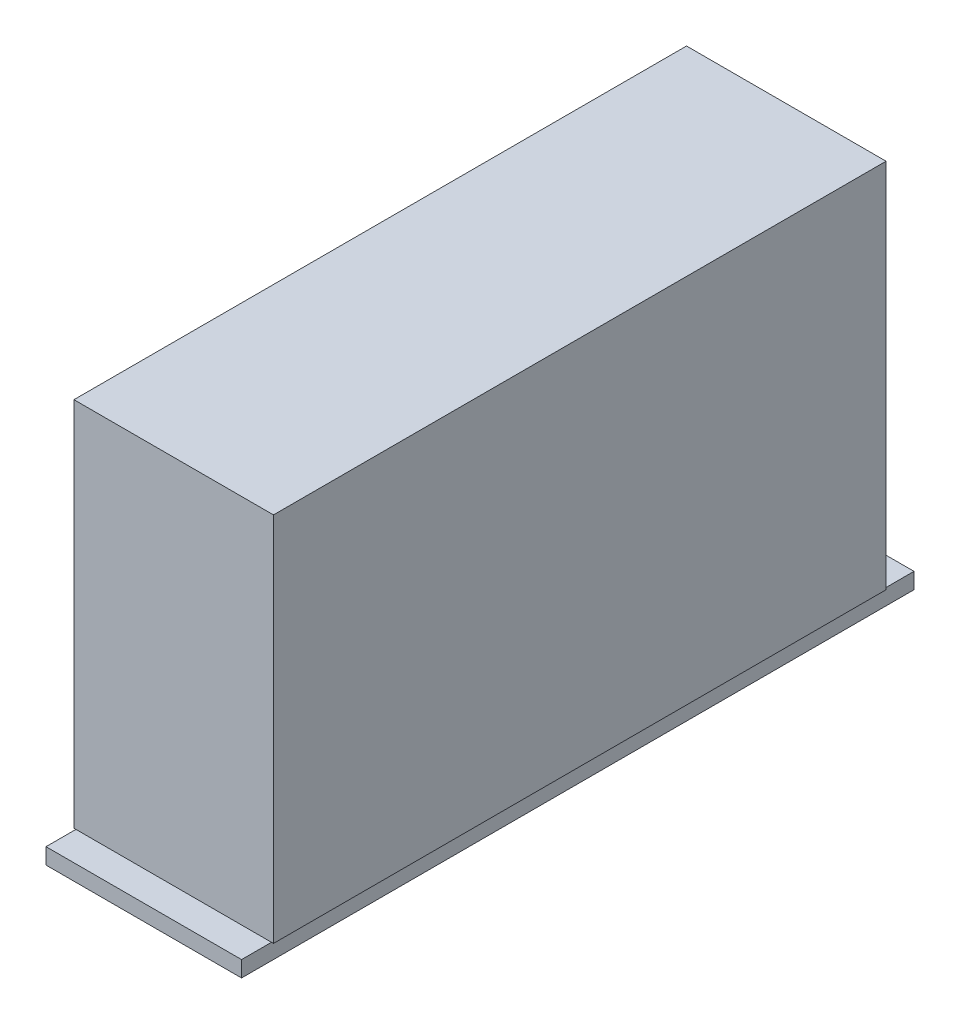
ISO-10303-21;
HEADER;
FILE_DESCRIPTION(('STEP AP214'),'2;1');
FILE_NAME('part.step','',(''),(''),'','','');
FILE_SCHEMA(('AUTOMOTIVE_DESIGN { 1 0 10303 214 1 1 1 1 }'));
ENDSEC;
DATA;
#1=APPLICATION_CONTEXT('core data for automotive mechanical design processes');
#2=APPLICATION_PROTOCOL_DEFINITION('international standard','automotive_design',2000,#1);
#3=PRODUCT_CONTEXT('',#1,'mechanical');
#4=PRODUCT('Part','Part','',(#3));
#5=PRODUCT_RELATED_PRODUCT_CATEGORY('part','',(#4));
#6=PRODUCT_DEFINITION_FORMATION('','',#4);
#7=PRODUCT_DEFINITION_CONTEXT('part definition',#1,'design');
#8=PRODUCT_DEFINITION('design','',#6,#7);
#9=PRODUCT_DEFINITION_SHAPE('','',#8);
#10=(LENGTH_UNIT() NAMED_UNIT(*) SI_UNIT(.MILLI.,.METRE.));
#11=(NAMED_UNIT(*) PLANE_ANGLE_UNIT() SI_UNIT($,.RADIAN.));
#12=(NAMED_UNIT(*) SI_UNIT($,.STERADIAN.) SOLID_ANGLE_UNIT());
#13=UNCERTAINTY_MEASURE_WITH_UNIT(LENGTH_MEASURE(1.E-05),#10,'distance_accuracy_value','');
#14=(GEOMETRIC_REPRESENTATION_CONTEXT(3) GLOBAL_UNCERTAINTY_ASSIGNED_CONTEXT((#13)) GLOBAL_UNIT_ASSIGNED_CONTEXT((#10,
#11,#12)) REPRESENTATION_CONTEXT('',''));
#15=CARTESIAN_POINT('',(0.,0.,0.));
#16=DIRECTION('',(0.,0.,1.));
#17=DIRECTION('',(1.,0.,0.));
#18=AXIS2_PLACEMENT_3D('',#15,#16,#17);
#19=CARTESIAN_POINT('',(-4.9,0.8,16.85));
#20=DIRECTION('',(0.,1.,0.));
#21=DIRECTION('',(0.,0.,1.));
#22=AXIS2_PLACEMENT_3D('',#19,#20,#21);
#23=PLANE('',#22);
#24=DIRECTION('',(1.,0.,0.));
#25=VECTOR('',#24,1.);
#26=CARTESIAN_POINT('',(5.,0.8,15.35));
#27=LINE('',#26,#25);
#28=CARTESIAN_POINT('',(-4.9,0.8,15.35));
#29=VERTEX_POINT('',#28);
#30=CARTESIAN_POINT('',(4.9,0.8,15.35));
#31=VERTEX_POINT('',#30);
#32=EDGE_CURVE('E11',#29,#31,#27,.T.);
#33=ORIENTED_EDGE('',*,*,#32,.F.);
#34=DIRECTION('',(0.,0.,1.));
#35=VECTOR('',#34,1.);
#36=CARTESIAN_POINT('',(-4.9,0.8,-16.85));
#37=LINE('',#36,#35);
#38=CARTESIAN_POINT('',(-4.9,0.8,16.85));
#39=VERTEX_POINT('',#38);
#40=EDGE_CURVE('E148',#29,#39,#37,.T.);
#41=ORIENTED_EDGE('',*,*,#40,.T.);
#42=DIRECTION('',(1.,0.,0.));
#43=VECTOR('',#42,1.);
#44=CARTESIAN_POINT('',(-4.9,0.8,16.85));
#45=LINE('',#44,#43);
#46=CARTESIAN_POINT('',(4.9,0.8,16.85));
#47=VERTEX_POINT('',#46);
#48=EDGE_CURVE('E151',#39,#47,#45,.T.);
#49=ORIENTED_EDGE('',*,*,#48,.T.);
#50=DIRECTION('',(0.,0.,-1.));
#51=VECTOR('',#50,1.);
#52=CARTESIAN_POINT('',(4.9,0.8,-16.85));
#53=LINE('',#52,#51);
#54=EDGE_CURVE('E155',#47,#31,#53,.T.);
#55=ORIENTED_EDGE('',*,*,#54,.T.);
#56=EDGE_LOOP('',(#33,#41,#49,#55));
#57=FACE_BOUND('',#56,.T.);
#58=ADVANCED_FACE('F17',(#57),#23,.T.);
#59=CARTESIAN_POINT('',(-4.9,0.8,-16.85));
#60=DIRECTION('',(1.,0.,0.));
#61=DIRECTION('',(0.,0.,-1.));
#62=AXIS2_PLACEMENT_3D('',#59,#60,#61);
#63=PLANE('',#62);
#64=DIRECTION('',(0.,0.,1.));
#65=VECTOR('',#64,1.);
#66=CARTESIAN_POINT('',(-4.9,0.,-16.85));
#67=LINE('',#66,#65);
#68=CARTESIAN_POINT('',(-4.9,0.,-16.85));
#69=VERTEX_POINT('',#68);
#70=CARTESIAN_POINT('',(-4.9,0.,16.85));
#71=VERTEX_POINT('',#70);
#72=EDGE_CURVE('E116',#69,#71,#67,.T.);
#73=ORIENTED_EDGE('',*,*,#72,.T.);
#74=DIRECTION('',(0.,-1.,0.));
#75=VECTOR('',#74,1.);
#76=CARTESIAN_POINT('',(-4.9,0.8,16.85));
#77=LINE('',#76,#75);
#78=EDGE_CURVE('E21',#39,#71,#77,.T.);
#79=ORIENTED_EDGE('',*,*,#78,.F.);
#80=ORIENTED_EDGE('',*,*,#40,.F.);
#81=CARTESIAN_POINT('',(-4.9,0.8,-15.35));
#82=VERTEX_POINT('',#81);
#83=EDGE_CURVE('E152',#82,#29,#37,.T.);
#84=ORIENTED_EDGE('',*,*,#83,.F.);
#85=CARTESIAN_POINT('',(-4.9,0.8,-16.85));
#86=VERTEX_POINT('',#85);
#87=EDGE_CURVE('E149',#86,#82,#37,.T.);
#88=ORIENTED_EDGE('',*,*,#87,.F.);
#89=DIRECTION('',(0.,-1.,0.));
#90=VECTOR('',#89,1.);
#91=CARTESIAN_POINT('',(-4.9,0.8,-16.85));
#92=LINE('',#91,#90);
#93=EDGE_CURVE('E159',#86,#69,#92,.T.);
#94=ORIENTED_EDGE('',*,*,#93,.T.);
#95=EDGE_LOOP('',(#73,#79,#80,#84,#88,#94));
#96=FACE_BOUND('',#95,.T.);
#97=ADVANCED_FACE('F19',(#96),#63,.F.);
#98=CARTESIAN_POINT('',(-4.9,0.8,16.85));
#99=DIRECTION('',(0.,0.,-1.));
#100=DIRECTION('',(-1.,0.,0.));
#101=AXIS2_PLACEMENT_3D('',#98,#99,#100);
#102=PLANE('',#101);
#103=DIRECTION('',(1.,0.,0.));
#104=VECTOR('',#103,1.);
#105=CARTESIAN_POINT('',(-4.9,0.,16.85));
#106=LINE('',#105,#104);
#107=CARTESIAN_POINT('',(4.9,0.,16.85));
#108=VERTEX_POINT('',#107);
#109=EDGE_CURVE('E142',#71,#108,#106,.T.);
#110=ORIENTED_EDGE('',*,*,#109,.T.);
#111=DIRECTION('',(0.,-1.,0.));
#112=VECTOR('',#111,1.);
#113=CARTESIAN_POINT('',(4.9,0.8,16.85));
#114=LINE('',#113,#112);
#115=EDGE_CURVE('E164',#47,#108,#114,.T.);
#116=ORIENTED_EDGE('',*,*,#115,.F.);
#117=ORIENTED_EDGE('',*,*,#48,.F.);
#118=ORIENTED_EDGE('',*,*,#78,.T.);
#119=EDGE_LOOP('',(#110,#116,#117,#118));
#120=FACE_BOUND('',#119,.T.);
#121=ADVANCED_FACE('F204',(#120),#102,.F.);
#122=CARTESIAN_POINT('',(4.9,0.8,-16.85));
#123=DIRECTION('',(-1.,0.,0.));
#124=DIRECTION('',(0.,0.,1.));
#125=AXIS2_PLACEMENT_3D('',#122,#123,#124);
#126=PLANE('',#125);
#127=DIRECTION('',(0.,0.,-1.));
#128=VECTOR('',#127,1.);
#129=CARTESIAN_POINT('',(4.9,0.,-16.85));
#130=LINE('',#129,#128);
#131=CARTESIAN_POINT('',(4.9,0.,-16.85));
#132=VERTEX_POINT('',#131);
#133=EDGE_CURVE('E144',#108,#132,#130,.T.);
#134=ORIENTED_EDGE('',*,*,#133,.T.);
#135=DIRECTION('',(0.,-1.,0.));
#136=VECTOR('',#135,1.);
#137=CARTESIAN_POINT('',(4.9,0.8,-16.85));
#138=LINE('',#137,#136);
#139=CARTESIAN_POINT('',(4.9,0.8,-16.85));
#140=VERTEX_POINT('',#139);
#141=EDGE_CURVE('E162',#140,#132,#138,.T.);
#142=ORIENTED_EDGE('',*,*,#141,.F.);
#143=CARTESIAN_POINT('',(4.9,0.8,-15.35));
#144=VERTEX_POINT('',#143);
#145=EDGE_CURVE('E154',#144,#140,#53,.T.);
#146=ORIENTED_EDGE('',*,*,#145,.F.);
#147=EDGE_CURVE('E42',#31,#144,#53,.T.);
#148=ORIENTED_EDGE('',*,*,#147,.F.);
#149=ORIENTED_EDGE('',*,*,#54,.F.);
#150=ORIENTED_EDGE('',*,*,#115,.T.);
#151=EDGE_LOOP('',(#134,#142,#146,#148,#149,#150));
#152=FACE_BOUND('',#151,.T.);
#153=ADVANCED_FACE('F216',(#152),#126,.F.);
#154=CARTESIAN_POINT('',(-4.9,0.8,-16.85));
#155=DIRECTION('',(0.,0.,1.));
#156=DIRECTION('',(1.,0.,0.));
#157=AXIS2_PLACEMENT_3D('',#154,#155,#156);
#158=PLANE('',#157);
#159=DIRECTION('',(-1.,0.,0.));
#160=VECTOR('',#159,1.);
#161=CARTESIAN_POINT('',(-4.9,0.,-16.85));
#162=LINE('',#161,#160);
#163=EDGE_CURVE('E146',#132,#69,#162,.T.);
#164=ORIENTED_EDGE('',*,*,#163,.T.);
#165=ORIENTED_EDGE('',*,*,#93,.F.);
#166=DIRECTION('',(-1.,0.,0.));
#167=VECTOR('',#166,1.);
#168=CARTESIAN_POINT('',(-4.9,0.8,-16.85));
#169=LINE('',#168,#167);
#170=EDGE_CURVE('E157',#140,#86,#169,.T.);
#171=ORIENTED_EDGE('',*,*,#170,.F.);
#172=ORIENTED_EDGE('',*,*,#141,.T.);
#173=EDGE_LOOP('',(#164,#165,#171,#172));
#174=FACE_BOUND('',#173,.T.);
#175=ADVANCED_FACE('F210',(#174),#158,.F.);
#176=DIRECTION('',(-1.,0.,0.));
#177=VECTOR('',#176,1.);
#178=CARTESIAN_POINT('',(5.,0.8,-15.35));
#179=LINE('',#178,#177);
#180=EDGE_CURVE('E26',#144,#82,#179,.T.);
#181=ORIENTED_EDGE('',*,*,#180,.F.);
#182=ORIENTED_EDGE('',*,*,#145,.T.);
#183=ORIENTED_EDGE('',*,*,#170,.T.);
#184=ORIENTED_EDGE('',*,*,#87,.T.);
#185=EDGE_LOOP('',(#181,#182,#183,#184));
#186=FACE_BOUND('',#185,.T.);
#187=ADVANCED_FACE('F200',(#186),#23,.T.);
#188=CARTESIAN_POINT('',(-4.9,0.,16.85));
#189=DIRECTION('',(0.,1.,0.));
#190=DIRECTION('',(0.,0.,1.));
#191=AXIS2_PLACEMENT_3D('',#188,#189,#190);
#192=PLANE('',#191);
#193=ORIENTED_EDGE('',*,*,#72,.F.);
#194=ORIENTED_EDGE('',*,*,#163,.F.);
#195=ORIENTED_EDGE('',*,*,#133,.F.);
#196=ORIENTED_EDGE('',*,*,#109,.F.);
#197=EDGE_LOOP('',(#193,#194,#195,#196));
#198=FACE_BOUND('',#197,.T.);
#199=ADVANCED_FACE('F209',(#198),#192,.F.);
#200=CARTESIAN_POINT('',(5.,0.8,15.35));
#201=DIRECTION('',(0.,-1.,0.));
#202=DIRECTION('',(0.,0.,-1.));
#203=AXIS2_PLACEMENT_3D('',#200,#201,#202);
#204=PLANE('',#203);
#205=CARTESIAN_POINT('',(-5.,0.8,-15.35));
#206=VERTEX_POINT('',#205);
#207=EDGE_CURVE('E106',#82,#206,#179,.T.);
#208=ORIENTED_EDGE('',*,*,#207,.F.);
#209=ORIENTED_EDGE('',*,*,#83,.T.);
#210=CARTESIAN_POINT('',(-5.,0.8,15.35));
#211=VERTEX_POINT('',#210);
#212=EDGE_CURVE('E28',#211,#29,#27,.T.);
#213=ORIENTED_EDGE('',*,*,#212,.F.);
#214=DIRECTION('',(0.,0.,1.));
#215=VECTOR('',#214,1.);
#216=CARTESIAN_POINT('',(-5.,0.8,-15.35));
#217=LINE('',#216,#215);
#218=EDGE_CURVE('E105',#206,#211,#217,.T.);
#219=ORIENTED_EDGE('',*,*,#218,.F.);
#220=EDGE_LOOP('',(#208,#209,#213,#219));
#221=FACE_BOUND('',#220,.T.);
#222=ADVANCED_FACE('F181',(#221),#204,.T.);
#223=CARTESIAN_POINT('',(5.,19.3999999999999,-15.35));
#224=DIRECTION('',(-1.,0.,0.));
#225=DIRECTION('',(0.,0.,1.));
#226=AXIS2_PLACEMENT_3D('',#223,#224,#225);
#227=PLANE('',#226);
#228=DIRECTION('',(0.,0.,-1.));
#229=VECTOR('',#228,1.);
#230=CARTESIAN_POINT('',(5.,0.8,-15.35));
#231=LINE('',#230,#229);
#232=CARTESIAN_POINT('',(5.,0.8,15.35));
#233=VERTEX_POINT('',#232);
#234=CARTESIAN_POINT('',(5.,0.8,-15.35));
#235=VERTEX_POINT('',#234);
#236=EDGE_CURVE('E103',#233,#235,#231,.T.);
#237=ORIENTED_EDGE('',*,*,#236,.T.);
#238=DIRECTION('',(0.,-1.,0.));
#239=VECTOR('',#238,1.);
#240=CARTESIAN_POINT('',(5.,19.3999999999999,-15.35));
#241=LINE('',#240,#239);
#242=CARTESIAN_POINT('',(5.,19.3999999999999,-15.35));
#243=VERTEX_POINT('',#242);
#244=EDGE_CURVE('E109',#243,#235,#241,.T.);
#245=ORIENTED_EDGE('',*,*,#244,.F.);
#246=DIRECTION('',(0.,0.,-1.));
#247=VECTOR('',#246,1.);
#248=CARTESIAN_POINT('',(5.,19.3999999999999,-15.35));
#249=LINE('',#248,#247);
#250=CARTESIAN_POINT('',(5.,19.3999999999999,15.35));
#251=VERTEX_POINT('',#250);
#252=EDGE_CURVE('E127',#251,#243,#249,.T.);
#253=ORIENTED_EDGE('',*,*,#252,.F.);
#254=DIRECTION('',(0.,-1.,0.));
#255=VECTOR('',#254,1.);
#256=CARTESIAN_POINT('',(5.,19.3999999999999,15.35));
#257=LINE('',#256,#255);
#258=EDGE_CURVE('E122',#251,#233,#257,.T.);
#259=ORIENTED_EDGE('',*,*,#258,.T.);
#260=EDGE_LOOP('',(#237,#245,#253,#259));
#261=FACE_BOUND('',#260,.T.);
#262=ADVANCED_FACE('F120',(#261),#227,.F.);
#263=CARTESIAN_POINT('',(5.,19.3999999999999,-15.35));
#264=DIRECTION('',(0.,0.,1.));
#265=DIRECTION('',(1.,0.,0.));
#266=AXIS2_PLACEMENT_3D('',#263,#264,#265);
#267=PLANE('',#266);
#268=EDGE_CURVE('E98',#235,#144,#179,.T.);
#269=ORIENTED_EDGE('',*,*,#268,.T.);
#270=ORIENTED_EDGE('',*,*,#180,.T.);
#271=ORIENTED_EDGE('',*,*,#207,.T.);
#272=DIRECTION('',(0.,-1.,0.));
#273=VECTOR('',#272,1.);
#274=CARTESIAN_POINT('',(-5.,19.3999999999999,-15.35));
#275=LINE('',#274,#273);
#276=CARTESIAN_POINT('',(-5.,19.3999999999999,-15.35));
#277=VERTEX_POINT('',#276);
#278=EDGE_CURVE('E117',#277,#206,#275,.T.);
#279=ORIENTED_EDGE('',*,*,#278,.F.);
#280=DIRECTION('',(-1.,0.,0.));
#281=VECTOR('',#280,1.);
#282=CARTESIAN_POINT('',(5.,19.3999999999999,-15.35));
#283=LINE('',#282,#281);
#284=EDGE_CURVE('E112',#243,#277,#283,.T.);
#285=ORIENTED_EDGE('',*,*,#284,.F.);
#286=ORIENTED_EDGE('',*,*,#244,.T.);
#287=EDGE_LOOP('',(#269,#270,#271,#279,#285,#286));
#288=FACE_BOUND('',#287,.T.);
#289=ADVANCED_FACE('F110',(#288),#267,.F.);
#290=CARTESIAN_POINT('',(-5.,19.3999999999999,-15.35));
#291=DIRECTION('',(1.,0.,0.));
#292=DIRECTION('',(0.,0.,-1.));
#293=AXIS2_PLACEMENT_3D('',#290,#291,#292);
#294=PLANE('',#293);
#295=ORIENTED_EDGE('',*,*,#218,.T.);
#296=DIRECTION('',(0.,-1.,0.));
#297=VECTOR('',#296,1.);
#298=CARTESIAN_POINT('',(-5.,19.3999999999999,15.35));
#299=LINE('',#298,#297);
#300=CARTESIAN_POINT('',(-5.,19.3999999999999,15.35));
#301=VERTEX_POINT('',#300);
#302=EDGE_CURVE('E135',#301,#211,#299,.T.);
#303=ORIENTED_EDGE('',*,*,#302,.F.);
#304=DIRECTION('',(0.,0.,1.));
#305=VECTOR('',#304,1.);
#306=CARTESIAN_POINT('',(-5.,19.3999999999999,-15.35));
#307=LINE('',#306,#305);
#308=EDGE_CURVE('E130',#277,#301,#307,.T.);
#309=ORIENTED_EDGE('',*,*,#308,.F.);
#310=ORIENTED_EDGE('',*,*,#278,.T.);
#311=EDGE_LOOP('',(#295,#303,#309,#310));
#312=FACE_BOUND('',#311,.T.);
#313=ADVANCED_FACE('F178',(#312),#294,.F.);
#314=CARTESIAN_POINT('',(5.,19.3999999999999,15.35));
#315=DIRECTION('',(0.,0.,-1.));
#316=DIRECTION('',(-1.,0.,0.));
#317=AXIS2_PLACEMENT_3D('',#314,#315,#316);
#318=PLANE('',#317);
#319=ORIENTED_EDGE('',*,*,#212,.T.);
#320=ORIENTED_EDGE('',*,*,#32,.T.);
#321=EDGE_CURVE('E29',#31,#233,#27,.T.);
#322=ORIENTED_EDGE('',*,*,#321,.T.);
#323=ORIENTED_EDGE('',*,*,#258,.F.);
#324=DIRECTION('',(1.,0.,0.));
#325=VECTOR('',#324,1.);
#326=CARTESIAN_POINT('',(5.,19.3999999999999,15.35));
#327=LINE('',#326,#325);
#328=EDGE_CURVE('E132',#301,#251,#327,.T.);
#329=ORIENTED_EDGE('',*,*,#328,.F.);
#330=ORIENTED_EDGE('',*,*,#302,.T.);
#331=EDGE_LOOP('',(#319,#320,#322,#323,#329,#330));
#332=FACE_BOUND('',#331,.T.);
#333=ADVANCED_FACE('F184',(#332),#318,.F.);
#334=CARTESIAN_POINT('',(5.,19.3999999999999,15.35));
#335=DIRECTION('',(0.,-1.,0.));
#336=DIRECTION('',(0.,0.,-1.));
#337=AXIS2_PLACEMENT_3D('',#334,#335,#336);
#338=PLANE('',#337);
#339=ORIENTED_EDGE('',*,*,#252,.T.);
#340=ORIENTED_EDGE('',*,*,#284,.T.);
#341=ORIENTED_EDGE('',*,*,#308,.T.);
#342=ORIENTED_EDGE('',*,*,#328,.T.);
#343=EDGE_LOOP('',(#339,#340,#341,#342));
#344=FACE_BOUND('',#343,.T.);
#345=ADVANCED_FACE('F187',(#344),#338,.F.);
#346=ORIENTED_EDGE('',*,*,#321,.F.);
#347=ORIENTED_EDGE('',*,*,#147,.T.);
#348=ORIENTED_EDGE('',*,*,#268,.F.);
#349=ORIENTED_EDGE('',*,*,#236,.F.);
#350=EDGE_LOOP('',(#346,#347,#348,#349));
#351=FACE_BOUND('',#350,.T.);
#352=ADVANCED_FACE('F101',(#351),#204,.T.);
#353=CLOSED_SHELL('',(#58,#97,#121,#153,#175,#187,#199,#222,#262,#289,#313,#333,#345,#352));
#354=MANIFOLD_SOLID_BREP('B1',#353);
#355=ADVANCED_BREP_SHAPE_REPRESENTATION('',(#18,#354),#14);
#356=SHAPE_DEFINITION_REPRESENTATION(#9,#355);
ENDSEC;
END-ISO-10303-21;
